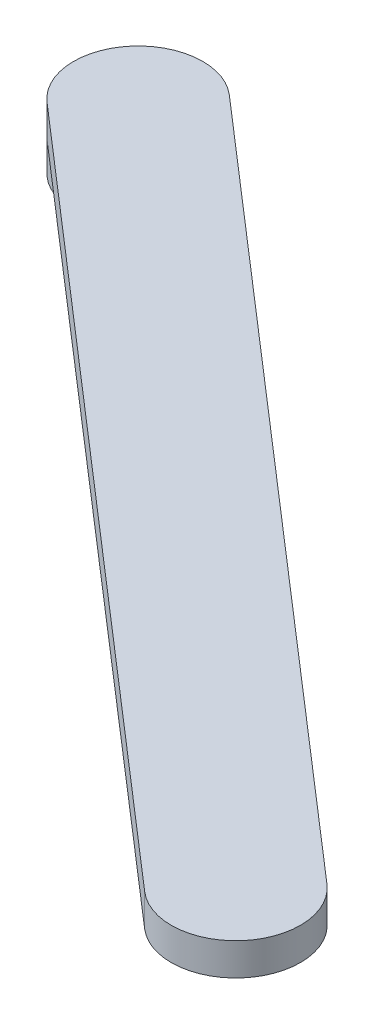
ISO-10303-21;
HEADER;
FILE_DESCRIPTION(('STEP AP214'),'2;1');
FILE_NAME('part.step','',(''),(''),'','','');
FILE_SCHEMA(('AUTOMOTIVE_DESIGN { 1 0 10303 214 1 1 1 1 }'));
ENDSEC;
DATA;
#1=APPLICATION_CONTEXT('core data for automotive mechanical design processes');
#2=APPLICATION_PROTOCOL_DEFINITION('international standard','automotive_design',2000,#1);
#3=PRODUCT_CONTEXT('',#1,'mechanical');
#4=PRODUCT('Part','Part','',(#3));
#5=PRODUCT_RELATED_PRODUCT_CATEGORY('part','',(#4));
#6=PRODUCT_DEFINITION_FORMATION('','',#4);
#7=PRODUCT_DEFINITION_CONTEXT('part definition',#1,'design');
#8=PRODUCT_DEFINITION('design','',#6,#7);
#9=PRODUCT_DEFINITION_SHAPE('','',#8);
#10=(LENGTH_UNIT() NAMED_UNIT(*) SI_UNIT(.MILLI.,.METRE.));
#11=(NAMED_UNIT(*) PLANE_ANGLE_UNIT() SI_UNIT($,.RADIAN.));
#12=(NAMED_UNIT(*) SI_UNIT($,.STERADIAN.) SOLID_ANGLE_UNIT());
#13=UNCERTAINTY_MEASURE_WITH_UNIT(LENGTH_MEASURE(1.E-05),#10,'distance_accuracy_value','');
#14=(GEOMETRIC_REPRESENTATION_CONTEXT(3) GLOBAL_UNCERTAINTY_ASSIGNED_CONTEXT((#13)) GLOBAL_UNIT_ASSIGNED_CONTEXT((#10,
#11,#12)) REPRESENTATION_CONTEXT('',''));
#15=CARTESIAN_POINT('',(0.,0.,0.));
#16=DIRECTION('',(0.,0.,1.));
#17=DIRECTION('',(1.,0.,0.));
#18=AXIS2_PLACEMENT_3D('',#15,#16,#17);
#19=CARTESIAN_POINT('',(0.,39.04234,0.));
#20=DIRECTION('',(0.,1.,0.));
#21=DIRECTION('',(0.,0.,1.));
#22=AXIS2_PLACEMENT_3D('',#19,#20,#21);
#23=PLANE('',#22);
#24=CARTESIAN_POINT('',(-40.2293851357301,39.04234,-62.3821337842994));
#25=DIRECTION('',(0.,-1.,0.));
#26=DIRECTION('',(0.,0.,-1.));
#27=AXIS2_PLACEMENT_3D('',#24,#25,#26);
#28=CIRCLE('',#27,6.34999999999998);
#29=CARTESIAN_POINT('',(-36.0705762167768,39.04234,-67.1807594600148));
#30=VERTEX_POINT('',#29);
#31=CARTESIAN_POINT('',(-44.3881940546834,39.04234,-57.5835081085841));
#32=VERTEX_POINT('',#31);
#33=EDGE_CURVE('E86',#30,#32,#28,.T.);
#34=ORIENTED_EDGE('',*,*,#33,.F.);
#35=DIRECTION('',(0.755689082789818,0.,0.654930538417842));
#36=VECTOR('',#35,1.);
#37=CARTESIAN_POINT('',(35.9088089189533,39.04234,-4.79862567571534));
#38=LINE('',#37,#36);
#39=CARTESIAN_POINT('',(35.9088089189533,39.04234,-4.79862567571534));
#40=VERTEX_POINT('',#39);
#41=EDGE_CURVE('E11',#30,#40,#38,.T.);
#42=ORIENTED_EDGE('',*,*,#41,.T.);
#43=CARTESIAN_POINT('',(31.75,39.04234,0.));
#44=DIRECTION('',(0.,1.,0.));
#45=DIRECTION('',(0.,0.,1.));
#46=AXIS2_PLACEMENT_3D('',#43,#44,#45);
#47=CIRCLE('',#46,6.34999999999999);
#48=CARTESIAN_POINT('',(27.5911910810467,39.04234,4.79862567571533));
#49=VERTEX_POINT('',#48);
#50=EDGE_CURVE('E48',#40,#49,#47,.F.);
#51=ORIENTED_EDGE('',*,*,#50,.T.);
#52=DIRECTION('',(-0.755689082789818,0.,-0.654930538417842));
#53=VECTOR('',#52,1.);
#54=CARTESIAN_POINT('',(27.5911910810467,39.04234,4.79862567571533));
#55=LINE('',#54,#53);
#56=EDGE_CURVE('E54',#49,#32,#55,.T.);
#57=ORIENTED_EDGE('',*,*,#56,.T.);
#58=EDGE_LOOP('',(#34,#42,#51,#57));
#59=FACE_BOUND('',#58,.T.);
#60=ADVANCED_FACE('F39',(#59),#23,.F.);
#61=CARTESIAN_POINT('',(31.75,-74.1297638090604,0.));
#62=DIRECTION('',(0.,1.,0.));
#63=DIRECTION('',(0.,0.,1.));
#64=AXIS2_PLACEMENT_3D('',#61,#62,#63);
#65=CYLINDRICAL_SURFACE('',#64,6.34999999999999);
#66=ORIENTED_EDGE('',*,*,#50,.F.);
#67=DIRECTION('',(0.,1.,0.));
#68=VECTOR('',#67,1.);
#69=CARTESIAN_POINT('',(35.9088089189533,-74.1297638090604,-4.79862567571534));
#70=LINE('',#69,#68);
#71=CARTESIAN_POINT('',(35.9088089189533,42.21734,-4.79862567571534));
#72=VERTEX_POINT('',#71);
#73=EDGE_CURVE('E80',#40,#72,#70,.T.);
#74=ORIENTED_EDGE('',*,*,#73,.T.);
#75=CARTESIAN_POINT('',(31.75,42.21734,0.));
#76=DIRECTION('',(0.,1.,0.));
#77=DIRECTION('',(0.,0.,1.));
#78=AXIS2_PLACEMENT_3D('',#75,#76,#77);
#79=CIRCLE('',#78,6.34999999999999);
#80=CARTESIAN_POINT('',(27.5911910810467,42.21734,4.79862567571533));
#81=VERTEX_POINT('',#80);
#82=EDGE_CURVE('E95',#81,#72,#79,.T.);
#83=ORIENTED_EDGE('',*,*,#82,.F.);
#84=DIRECTION('',(0.,1.,0.));
#85=VECTOR('',#84,1.);
#86=CARTESIAN_POINT('',(27.5911910810467,-74.1297638090604,4.79862567571533));
#87=LINE('',#86,#85);
#88=EDGE_CURVE('E99',#49,#81,#87,.T.);
#89=ORIENTED_EDGE('',*,*,#88,.F.);
#90=EDGE_LOOP('',(#66,#74,#83,#89));
#91=FACE_BOUND('',#90,.T.);
#92=ADVANCED_FACE('F41',(#91),#65,.T.);
#93=CARTESIAN_POINT('',(27.5911910810467,-74.1297638090604,4.79862567571533));
#94=DIRECTION('',(-0.654930538417842,0.,0.755689082789818));
#95=DIRECTION('',(0.755689082789818,0.,0.654930538417842));
#96=AXIS2_PLACEMENT_3D('',#93,#94,#95);
#97=PLANE('',#96);
#98=ORIENTED_EDGE('',*,*,#56,.F.);
#99=ORIENTED_EDGE('',*,*,#88,.T.);
#100=DIRECTION('',(0.755689082789818,0.,0.654930538417842));
#101=VECTOR('',#100,1.);
#102=CARTESIAN_POINT('',(27.5911910810467,42.21734,4.79862567571533));
#103=LINE('',#102,#101);
#104=CARTESIAN_POINT('',(-44.3881940546834,42.21734,-57.5835081085841));
#105=VERTEX_POINT('',#104);
#106=EDGE_CURVE('E106',#105,#81,#103,.T.);
#107=ORIENTED_EDGE('',*,*,#106,.F.);
#108=DIRECTION('',(0.,1.,0.));
#109=VECTOR('',#108,1.);
#110=CARTESIAN_POINT('',(-44.3881940546834,-74.1297638090604,-57.5835081085841));
#111=LINE('',#110,#109);
#112=EDGE_CURVE('E90',#32,#105,#111,.T.);
#113=ORIENTED_EDGE('',*,*,#112,.F.);
#114=EDGE_LOOP('',(#98,#99,#107,#113));
#115=FACE_BOUND('',#114,.T.);
#116=ADVANCED_FACE('F117',(#115),#97,.T.);
#117=CARTESIAN_POINT('',(-40.2293851357301,-74.1297638090604,-62.3821337842994));
#118=DIRECTION('',(0.,1.,0.));
#119=DIRECTION('',(0.,0.,1.));
#120=AXIS2_PLACEMENT_3D('',#117,#118,#119);
#121=CYLINDRICAL_SURFACE('',#120,6.34999999999999);
#122=DIRECTION('',(0.,1.,0.));
#123=VECTOR('',#122,1.);
#124=CARTESIAN_POINT('',(-36.0705762167768,-74.1297638090604,-67.1807594600148));
#125=LINE('',#124,#123);
#126=CARTESIAN_POINT('',(-36.0705762167768,42.21734,-67.1807594600148));
#127=VERTEX_POINT('',#126);
#128=EDGE_CURVE('E78',#30,#127,#125,.T.);
#129=ORIENTED_EDGE('',*,*,#128,.F.);
#130=ORIENTED_EDGE('',*,*,#33,.T.);
#131=ORIENTED_EDGE('',*,*,#112,.T.);
#132=CARTESIAN_POINT('',(-40.2293851357301,42.21734,-62.3821337842994));
#133=DIRECTION('',(0.,1.,0.));
#134=DIRECTION('',(0.,0.,1.));
#135=AXIS2_PLACEMENT_3D('',#132,#133,#134);
#136=CIRCLE('',#135,6.34999999999999);
#137=EDGE_CURVE('E88',#127,#105,#136,.T.);
#138=ORIENTED_EDGE('',*,*,#137,.F.);
#139=EDGE_LOOP('',(#129,#130,#131,#138));
#140=FACE_BOUND('',#139,.T.);
#141=CARTESIAN_POINT('',(-40.2293851357301,35.86734,-62.3821337842994));
#142=DIRECTION('',(0.,1.,0.));
#143=DIRECTION('',(0.,0.,1.));
#144=AXIS2_PLACEMENT_3D('',#141,#142,#143);
#145=CIRCLE('',#144,6.34999999999998);
#146=CARTESIAN_POINT('',(-40.2293851357301,35.86734,-56.0321337842995));
#147=VERTEX_POINT('',#146);
#148=EDGE_CURVE('E92',#147,#147,#145,.T.);
#149=ORIENTED_EDGE('',*,*,#148,.T.);
#150=EDGE_LOOP('',(#149));
#151=FACE_BOUND('',#150,.T.);
#152=ADVANCED_FACE('F84',(#140,#151),#121,.T.);
#153=CARTESIAN_POINT('',(35.9088089189533,-74.1297638090604,-4.79862567571534));
#154=DIRECTION('',(0.654930538417842,0.,-0.755689082789818));
#155=DIRECTION('',(-0.755689082789818,0.,-0.654930538417842));
#156=AXIS2_PLACEMENT_3D('',#153,#154,#155);
#157=PLANE('',#156);
#158=ORIENTED_EDGE('',*,*,#41,.F.);
#159=ORIENTED_EDGE('',*,*,#128,.T.);
#160=DIRECTION('',(-0.755689082789818,0.,-0.654930538417842));
#161=VECTOR('',#160,1.);
#162=CARTESIAN_POINT('',(35.9088089189533,42.21734,-4.79862567571534));
#163=LINE('',#162,#161);
#164=EDGE_CURVE('E103',#72,#127,#163,.T.);
#165=ORIENTED_EDGE('',*,*,#164,.F.);
#166=ORIENTED_EDGE('',*,*,#73,.F.);
#167=EDGE_LOOP('',(#158,#159,#165,#166));
#168=FACE_BOUND('',#167,.T.);
#169=ADVANCED_FACE('F76',(#168),#157,.T.);
#170=CARTESIAN_POINT('',(31.75,42.21734,0.));
#171=DIRECTION('',(0.,1.,0.));
#172=DIRECTION('',(0.,0.,1.));
#173=AXIS2_PLACEMENT_3D('',#170,#171,#172);
#174=PLANE('',#173);
#175=ORIENTED_EDGE('',*,*,#82,.T.);
#176=ORIENTED_EDGE('',*,*,#164,.T.);
#177=ORIENTED_EDGE('',*,*,#137,.T.);
#178=ORIENTED_EDGE('',*,*,#106,.T.);
#179=EDGE_LOOP('',(#175,#176,#177,#178));
#180=FACE_BOUND('',#179,.T.);
#181=ADVANCED_FACE('F114',(#180),#174,.T.);
#182=CARTESIAN_POINT('',(0.,35.86734,0.));
#183=DIRECTION('',(0.,1.,0.));
#184=DIRECTION('',(0.,0.,1.));
#185=AXIS2_PLACEMENT_3D('',#182,#183,#184);
#186=PLANE('',#185);
#187=ORIENTED_EDGE('',*,*,#148,.F.);
#188=EDGE_LOOP('',(#187));
#189=FACE_BOUND('',#188,.T.);
#190=ADVANCED_FACE('F132',(#189),#186,.F.);
#191=CLOSED_SHELL('',(#60,#92,#116,#152,#169,#181,#190));
#192=MANIFOLD_SOLID_BREP('B2',#191);
#193=ADVANCED_BREP_SHAPE_REPRESENTATION('',(#18,#192),#14);
#194=SHAPE_DEFINITION_REPRESENTATION(#9,#193);
ENDSEC;
END-ISO-10303-21;
